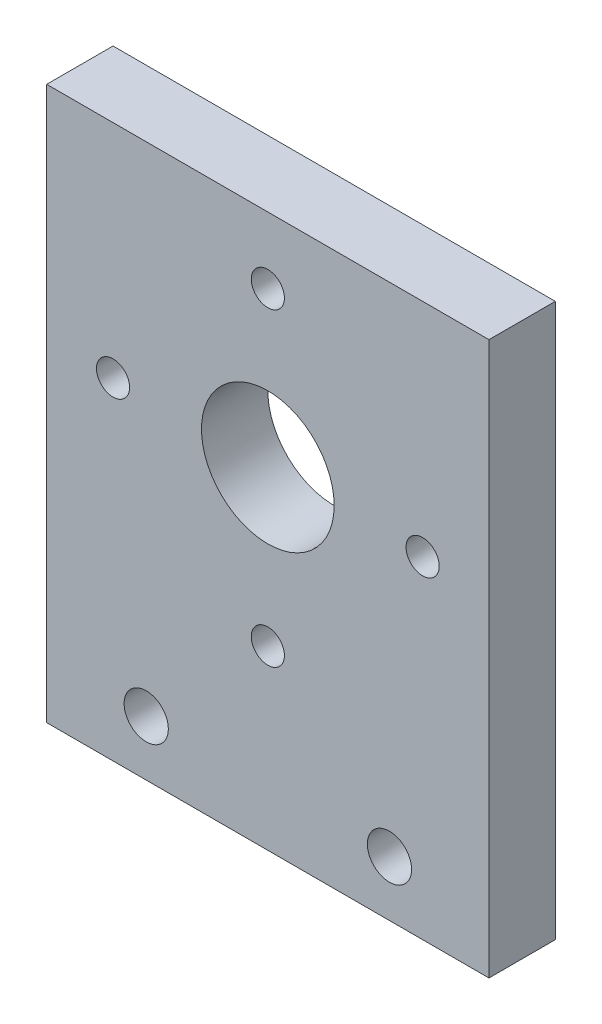
ISO-10303-21;
HEADER;
FILE_DESCRIPTION(('STEP AP214'),'2;1');
FILE_NAME('part.step','',(''),(''),'','','');
FILE_SCHEMA(('AUTOMOTIVE_DESIGN { 1 0 10303 214 1 1 1 1 }'));
ENDSEC;
DATA;
#1=APPLICATION_CONTEXT('core data for automotive mechanical design processes');
#2=APPLICATION_PROTOCOL_DEFINITION('international standard','automotive_design',2000,#1);
#3=PRODUCT_CONTEXT('',#1,'mechanical');
#4=PRODUCT('Part','Part','',(#3));
#5=PRODUCT_RELATED_PRODUCT_CATEGORY('part','',(#4));
#6=PRODUCT_DEFINITION_FORMATION('','',#4);
#7=PRODUCT_DEFINITION_CONTEXT('part definition',#1,'design');
#8=PRODUCT_DEFINITION('design','',#6,#7);
#9=PRODUCT_DEFINITION_SHAPE('','',#8);
#10=(LENGTH_UNIT() NAMED_UNIT(*) SI_UNIT(.MILLI.,.METRE.));
#11=(NAMED_UNIT(*) PLANE_ANGLE_UNIT() SI_UNIT($,.RADIAN.));
#12=(NAMED_UNIT(*) SI_UNIT($,.STERADIAN.) SOLID_ANGLE_UNIT());
#13=UNCERTAINTY_MEASURE_WITH_UNIT(LENGTH_MEASURE(1.E-05),#10,'distance_accuracy_value','');
#14=(GEOMETRIC_REPRESENTATION_CONTEXT(3) GLOBAL_UNCERTAINTY_ASSIGNED_CONTEXT((#13)) GLOBAL_UNIT_ASSIGNED_CONTEXT((#10,
#11,#12)) REPRESENTATION_CONTEXT('',''));
#15=CARTESIAN_POINT('',(0.,0.,0.));
#16=DIRECTION('',(0.,0.,1.));
#17=DIRECTION('',(1.,0.,0.));
#18=AXIS2_PLACEMENT_3D('',#15,#16,#17);
#19=CARTESIAN_POINT('',(20.,0.,3.));
#20=DIRECTION('',(-1.,0.,0.));
#21=DIRECTION('',(0.,0.,1.));
#22=AXIS2_PLACEMENT_3D('',#19,#20,#21);
#23=PLANE('',#22);
#24=DIRECTION('',(0.,1.,0.));
#25=VECTOR('',#24,1.);
#26=CARTESIAN_POINT('',(20.,0.,0.));
#27=LINE('',#26,#25);
#28=CARTESIAN_POINT('',(20.,-25.,0.));
#29=VERTEX_POINT('',#28);
#30=CARTESIAN_POINT('',(20.,0.,0.));
#31=VERTEX_POINT('',#30);
#32=EDGE_CURVE('E146',#29,#31,#27,.T.);
#33=ORIENTED_EDGE('',*,*,#32,.T.);
#34=DIRECTION('',(0.,0.,-1.));
#35=VECTOR('',#34,1.);
#36=CARTESIAN_POINT('',(20.,0.,3.));
#37=LINE('',#36,#35);
#38=CARTESIAN_POINT('',(20.,0.,3.));
#39=VERTEX_POINT('',#38);
#40=EDGE_CURVE('E11',#39,#31,#37,.T.);
#41=ORIENTED_EDGE('',*,*,#40,.F.);
#42=DIRECTION('',(0.,1.,0.));
#43=VECTOR('',#42,1.);
#44=CARTESIAN_POINT('',(20.,0.,3.));
#45=LINE('',#44,#43);
#46=CARTESIAN_POINT('',(20.,-25.,3.));
#47=VERTEX_POINT('',#46);
#48=EDGE_CURVE('E89',#47,#39,#45,.T.);
#49=ORIENTED_EDGE('',*,*,#48,.F.);
#50=DIRECTION('',(0.,0.,-1.));
#51=VECTOR('',#50,1.);
#52=CARTESIAN_POINT('',(20.,-25.,3.));
#53=LINE('',#52,#51);
#54=EDGE_CURVE('E137',#47,#29,#53,.T.);
#55=ORIENTED_EDGE('',*,*,#54,.T.);
#56=EDGE_LOOP('',(#33,#41,#49,#55));
#57=FACE_BOUND('',#56,.T.);
#58=ADVANCED_FACE('F45',(#57),#23,.F.);
#59=CARTESIAN_POINT('',(0.,0.,3.));
#60=DIRECTION('',(0.,1.,0.));
#61=DIRECTION('',(0.,0.,1.));
#62=AXIS2_PLACEMENT_3D('',#59,#60,#61);
#63=PLANE('',#62);
#64=DIRECTION('',(1.,0.,0.));
#65=VECTOR('',#64,1.);
#66=CARTESIAN_POINT('',(0.,0.,0.));
#67=LINE('',#66,#65);
#68=CARTESIAN_POINT('',(0.,0.,0.));
#69=VERTEX_POINT('',#68);
#70=EDGE_CURVE('E99',#69,#31,#67,.T.);
#71=ORIENTED_EDGE('',*,*,#70,.F.);
#72=DIRECTION('',(0.,0.,-1.));
#73=VECTOR('',#72,1.);
#74=CARTESIAN_POINT('',(0.,0.,3.));
#75=LINE('',#74,#73);
#76=CARTESIAN_POINT('',(0.,0.,3.));
#77=VERTEX_POINT('',#76);
#78=EDGE_CURVE('E55',#77,#69,#75,.T.);
#79=ORIENTED_EDGE('',*,*,#78,.F.);
#80=DIRECTION('',(1.,0.,0.));
#81=VECTOR('',#80,1.);
#82=CARTESIAN_POINT('',(0.,0.,3.));
#83=LINE('',#82,#81);
#84=EDGE_CURVE('E97',#77,#39,#83,.T.);
#85=ORIENTED_EDGE('',*,*,#84,.T.);
#86=ORIENTED_EDGE('',*,*,#40,.T.);
#87=EDGE_LOOP('',(#71,#79,#85,#86));
#88=FACE_BOUND('',#87,.T.);
#89=ADVANCED_FACE('F96',(#88),#63,.T.);
#90=CARTESIAN_POINT('',(0.,0.,3.));
#91=DIRECTION('',(1.,0.,0.));
#92=DIRECTION('',(0.,1.,0.));
#93=AXIS2_PLACEMENT_3D('',#90,#91,#92);
#94=PLANE('',#93);
#95=DIRECTION('',(0.,-1.,0.));
#96=VECTOR('',#95,1.);
#97=CARTESIAN_POINT('',(0.,0.,0.));
#98=LINE('',#97,#96);
#99=CARTESIAN_POINT('',(0.,-25.,0.));
#100=VERTEX_POINT('',#99);
#101=EDGE_CURVE('E78',#69,#100,#98,.T.);
#102=ORIENTED_EDGE('',*,*,#101,.T.);
#103=DIRECTION('',(0.,0.,-1.));
#104=VECTOR('',#103,1.);
#105=CARTESIAN_POINT('',(0.,-25.,3.));
#106=LINE('',#105,#104);
#107=CARTESIAN_POINT('',(0.,-25.,3.));
#108=VERTEX_POINT('',#107);
#109=EDGE_CURVE('E101',#108,#100,#106,.T.);
#110=ORIENTED_EDGE('',*,*,#109,.F.);
#111=DIRECTION('',(0.,-1.,0.));
#112=VECTOR('',#111,1.);
#113=CARTESIAN_POINT('',(0.,0.,3.));
#114=LINE('',#113,#112);
#115=EDGE_CURVE('E102',#77,#108,#114,.T.);
#116=ORIENTED_EDGE('',*,*,#115,.F.);
#117=ORIENTED_EDGE('',*,*,#78,.T.);
#118=EDGE_LOOP('',(#102,#110,#116,#117));
#119=FACE_BOUND('',#118,.T.);
#120=ADVANCED_FACE('F103',(#119),#94,.F.);
#121=CARTESIAN_POINT('',(17.,-10.,3.));
#122=DIRECTION('',(0.,0.,-1.));
#123=DIRECTION('',(-1.,0.,0.));
#124=AXIS2_PLACEMENT_3D('',#121,#122,#123);
#125=CYLINDRICAL_SURFACE('',#124,0.750000000000002);
#126=CARTESIAN_POINT('',(17.,-10.,3.));
#127=DIRECTION('',(0.,0.,1.));
#128=DIRECTION('',(1.,0.,0.));
#129=AXIS2_PLACEMENT_3D('',#126,#127,#128);
#130=CIRCLE('',#129,0.750000000000002);
#131=CARTESIAN_POINT('',(17.75,-10.,3.));
#132=VERTEX_POINT('',#131);
#133=EDGE_CURVE('E129',#132,#132,#130,.T.);
#134=ORIENTED_EDGE('',*,*,#133,.T.);
#135=EDGE_LOOP('',(#134));
#136=FACE_BOUND('',#135,.T.);
#137=CARTESIAN_POINT('',(17.,-10.,0.));
#138=DIRECTION('',(0.,0.,1.));
#139=DIRECTION('',(1.,0.,0.));
#140=AXIS2_PLACEMENT_3D('',#137,#138,#139);
#141=CIRCLE('',#140,0.750000000000002);
#142=CARTESIAN_POINT('',(17.75,-10.,0.));
#143=VERTEX_POINT('',#142);
#144=EDGE_CURVE('E168',#143,#143,#141,.T.);
#145=ORIENTED_EDGE('',*,*,#144,.F.);
#146=EDGE_LOOP('',(#145));
#147=FACE_BOUND('',#146,.T.);
#148=ADVANCED_FACE('F221',(#136,#147),#125,.F.);
#149=CARTESIAN_POINT('',(10.,-3.,3.));
#150=DIRECTION('',(0.,0.,-1.));
#151=DIRECTION('',(-1.,0.,0.));
#152=AXIS2_PLACEMENT_3D('',#149,#150,#151);
#153=CYLINDRICAL_SURFACE('',#152,0.75);
#154=CARTESIAN_POINT('',(10.,-3.,3.));
#155=DIRECTION('',(0.,0.,1.));
#156=DIRECTION('',(1.,0.,0.));
#157=AXIS2_PLACEMENT_3D('',#154,#155,#156);
#158=CIRCLE('',#157,0.75);
#159=CARTESIAN_POINT('',(10.75,-3.,3.));
#160=VERTEX_POINT('',#159);
#161=EDGE_CURVE('E125',#160,#160,#158,.T.);
#162=ORIENTED_EDGE('',*,*,#161,.T.);
#163=EDGE_LOOP('',(#162));
#164=FACE_BOUND('',#163,.T.);
#165=CARTESIAN_POINT('',(10.,-3.,0.));
#166=DIRECTION('',(0.,0.,1.));
#167=DIRECTION('',(1.,0.,0.));
#168=AXIS2_PLACEMENT_3D('',#165,#166,#167);
#169=CIRCLE('',#168,0.75);
#170=CARTESIAN_POINT('',(10.75,-3.,0.));
#171=VERTEX_POINT('',#170);
#172=EDGE_CURVE('E164',#171,#171,#169,.T.);
#173=ORIENTED_EDGE('',*,*,#172,.F.);
#174=EDGE_LOOP('',(#173));
#175=FACE_BOUND('',#174,.T.);
#176=ADVANCED_FACE('F224',(#164,#175),#153,.F.);
#177=CARTESIAN_POINT('',(3.,-10.,3.));
#178=DIRECTION('',(0.,0.,-1.));
#179=DIRECTION('',(-1.,0.,0.));
#180=AXIS2_PLACEMENT_3D('',#177,#178,#179);
#181=CYLINDRICAL_SURFACE('',#180,0.75);
#182=CARTESIAN_POINT('',(3.,-10.,3.));
#183=DIRECTION('',(0.,0.,1.));
#184=DIRECTION('',(1.,0.,0.));
#185=AXIS2_PLACEMENT_3D('',#182,#183,#184);
#186=CIRCLE('',#185,0.75);
#187=CARTESIAN_POINT('',(3.75,-10.,3.));
#188=VERTEX_POINT('',#187);
#189=EDGE_CURVE('E121',#188,#188,#186,.T.);
#190=ORIENTED_EDGE('',*,*,#189,.T.);
#191=EDGE_LOOP('',(#190));
#192=FACE_BOUND('',#191,.T.);
#193=CARTESIAN_POINT('',(3.,-10.,0.));
#194=DIRECTION('',(0.,0.,1.));
#195=DIRECTION('',(1.,0.,0.));
#196=AXIS2_PLACEMENT_3D('',#193,#194,#195);
#197=CIRCLE('',#196,0.75);
#198=CARTESIAN_POINT('',(3.75,-10.,0.));
#199=VERTEX_POINT('',#198);
#200=EDGE_CURVE('E160',#199,#199,#197,.T.);
#201=ORIENTED_EDGE('',*,*,#200,.F.);
#202=EDGE_LOOP('',(#201));
#203=FACE_BOUND('',#202,.T.);
#204=ADVANCED_FACE('F228',(#192,#203),#181,.F.);
#205=CARTESIAN_POINT('',(10.,-17.,3.));
#206=DIRECTION('',(0.,0.,-1.));
#207=DIRECTION('',(-1.,0.,0.));
#208=AXIS2_PLACEMENT_3D('',#205,#206,#207);
#209=CYLINDRICAL_SURFACE('',#208,0.75);
#210=CARTESIAN_POINT('',(10.,-17.,3.));
#211=DIRECTION('',(0.,0.,1.));
#212=DIRECTION('',(1.,0.,0.));
#213=AXIS2_PLACEMENT_3D('',#210,#211,#212);
#214=CIRCLE('',#213,0.75);
#215=CARTESIAN_POINT('',(10.75,-17.,3.));
#216=VERTEX_POINT('',#215);
#217=EDGE_CURVE('E117',#216,#216,#214,.T.);
#218=ORIENTED_EDGE('',*,*,#217,.T.);
#219=EDGE_LOOP('',(#218));
#220=FACE_BOUND('',#219,.T.);
#221=CARTESIAN_POINT('',(10.,-17.,0.));
#222=DIRECTION('',(0.,0.,1.));
#223=DIRECTION('',(1.,0.,0.));
#224=AXIS2_PLACEMENT_3D('',#221,#222,#223);
#225=CIRCLE('',#224,0.75);
#226=CARTESIAN_POINT('',(10.75,-17.,0.));
#227=VERTEX_POINT('',#226);
#228=EDGE_CURVE('E156',#227,#227,#225,.T.);
#229=ORIENTED_EDGE('',*,*,#228,.F.);
#230=EDGE_LOOP('',(#229));
#231=FACE_BOUND('',#230,.T.);
#232=ADVANCED_FACE('F202',(#220,#231),#209,.F.);
#233=CARTESIAN_POINT('',(0.,-25.,3.));
#234=DIRECTION('',(0.,1.,0.));
#235=DIRECTION('',(0.,0.,1.));
#236=AXIS2_PLACEMENT_3D('',#233,#234,#235);
#237=PLANE('',#236);
#238=DIRECTION('',(1.,0.,0.));
#239=VECTOR('',#238,1.);
#240=CARTESIAN_POINT('',(0.,-25.,0.));
#241=LINE('',#240,#239);
#242=EDGE_CURVE('E84',#100,#29,#241,.T.);
#243=ORIENTED_EDGE('',*,*,#242,.T.);
#244=ORIENTED_EDGE('',*,*,#54,.F.);
#245=DIRECTION('',(1.,0.,0.));
#246=VECTOR('',#245,1.);
#247=CARTESIAN_POINT('',(0.,-25.,3.));
#248=LINE('',#247,#246);
#249=EDGE_CURVE('E63',#108,#47,#248,.T.);
#250=ORIENTED_EDGE('',*,*,#249,.F.);
#251=ORIENTED_EDGE('',*,*,#109,.T.);
#252=EDGE_LOOP('',(#243,#244,#250,#251));
#253=FACE_BOUND('',#252,.T.);
#254=ADVANCED_FACE('F180',(#253),#237,.F.);
#255=CARTESIAN_POINT('',(4.5,-22.5,3.));
#256=DIRECTION('',(0.,0.,-1.));
#257=DIRECTION('',(-1.,0.,0.));
#258=AXIS2_PLACEMENT_3D('',#255,#256,#257);
#259=CYLINDRICAL_SURFACE('',#258,1.);
#260=CARTESIAN_POINT('',(4.5,-22.5,3.));
#261=DIRECTION('',(0.,0.,1.));
#262=DIRECTION('',(1.,0.,0.));
#263=AXIS2_PLACEMENT_3D('',#260,#261,#262);
#264=CIRCLE('',#263,1.);
#265=CARTESIAN_POINT('',(5.5,-22.5,3.));
#266=VERTEX_POINT('',#265);
#267=EDGE_CURVE('E111',#266,#266,#264,.T.);
#268=ORIENTED_EDGE('',*,*,#267,.T.);
#269=EDGE_LOOP('',(#268));
#270=FACE_BOUND('',#269,.T.);
#271=CARTESIAN_POINT('',(4.5,-22.5,0.));
#272=DIRECTION('',(0.,0.,1.));
#273=DIRECTION('',(1.,0.,0.));
#274=AXIS2_PLACEMENT_3D('',#271,#272,#273);
#275=CIRCLE('',#274,1.);
#276=CARTESIAN_POINT('',(5.5,-22.5,0.));
#277=VERTEX_POINT('',#276);
#278=EDGE_CURVE('E142',#277,#277,#275,.T.);
#279=ORIENTED_EDGE('',*,*,#278,.F.);
#280=EDGE_LOOP('',(#279));
#281=FACE_BOUND('',#280,.T.);
#282=ADVANCED_FACE('F193',(#270,#281),#259,.F.);
#283=CARTESIAN_POINT('',(15.5,-22.5,3.));
#284=DIRECTION('',(0.,0.,-1.));
#285=DIRECTION('',(-1.,0.,0.));
#286=AXIS2_PLACEMENT_3D('',#283,#284,#285);
#287=CYLINDRICAL_SURFACE('',#286,1.);
#288=CARTESIAN_POINT('',(15.5,-22.5,3.));
#289=DIRECTION('',(0.,0.,1.));
#290=DIRECTION('',(1.,0.,0.));
#291=AXIS2_PLACEMENT_3D('',#288,#289,#290);
#292=CIRCLE('',#291,1.);
#293=CARTESIAN_POINT('',(16.5,-22.5,3.));
#294=VERTEX_POINT('',#293);
#295=EDGE_CURVE('E176',#294,#294,#292,.T.);
#296=ORIENTED_EDGE('',*,*,#295,.T.);
#297=EDGE_LOOP('',(#296));
#298=FACE_BOUND('',#297,.T.);
#299=CARTESIAN_POINT('',(15.5,-22.5,0.));
#300=DIRECTION('',(0.,0.,1.));
#301=DIRECTION('',(1.,0.,0.));
#302=AXIS2_PLACEMENT_3D('',#299,#300,#301);
#303=CIRCLE('',#302,1.);
#304=CARTESIAN_POINT('',(16.5,-22.5,0.));
#305=VERTEX_POINT('',#304);
#306=EDGE_CURVE('E138',#305,#305,#303,.T.);
#307=ORIENTED_EDGE('',*,*,#306,.F.);
#308=EDGE_LOOP('',(#307));
#309=FACE_BOUND('',#308,.T.);
#310=ADVANCED_FACE('F47',(#298,#309),#287,.F.);
#311=CARTESIAN_POINT('',(10.,-10.,3.));
#312=DIRECTION('',(0.,0.,-1.));
#313=DIRECTION('',(-1.,0.,0.));
#314=AXIS2_PLACEMENT_3D('',#311,#312,#313);
#315=CYLINDRICAL_SURFACE('',#314,3.);
#316=CARTESIAN_POINT('',(10.,-10.,3.));
#317=DIRECTION('',(0.,0.,1.));
#318=DIRECTION('',(1.,0.,0.));
#319=AXIS2_PLACEMENT_3D('',#316,#317,#318);
#320=CIRCLE('',#319,3.);
#321=CARTESIAN_POINT('',(13.,-10.,3.));
#322=VERTEX_POINT('',#321);
#323=EDGE_CURVE('E133',#322,#322,#320,.T.);
#324=ORIENTED_EDGE('',*,*,#323,.T.);
#325=EDGE_LOOP('',(#324));
#326=FACE_BOUND('',#325,.T.);
#327=CARTESIAN_POINT('',(10.,-10.,0.));
#328=DIRECTION('',(0.,0.,1.));
#329=DIRECTION('',(1.,0.,0.));
#330=AXIS2_PLACEMENT_3D('',#327,#328,#329);
#331=CIRCLE('',#330,3.);
#332=CARTESIAN_POINT('',(13.,-10.,0.));
#333=VERTEX_POINT('',#332);
#334=EDGE_CURVE('E172',#333,#333,#331,.T.);
#335=ORIENTED_EDGE('',*,*,#334,.F.);
#336=EDGE_LOOP('',(#335));
#337=FACE_BOUND('',#336,.T.);
#338=ADVANCED_FACE('F200',(#326,#337),#315,.F.);
#339=CARTESIAN_POINT('',(0.,0.,3.));
#340=DIRECTION('',(0.,0.,1.));
#341=DIRECTION('',(1.,0.,0.));
#342=AXIS2_PLACEMENT_3D('',#339,#340,#341);
#343=PLANE('',#342);
#344=ORIENTED_EDGE('',*,*,#295,.F.);
#345=EDGE_LOOP('',(#344));
#346=FACE_BOUND('',#345,.T.);
#347=ORIENTED_EDGE('',*,*,#267,.F.);
#348=EDGE_LOOP('',(#347));
#349=FACE_BOUND('',#348,.T.);
#350=ORIENTED_EDGE('',*,*,#48,.T.);
#351=ORIENTED_EDGE('',*,*,#84,.F.);
#352=ORIENTED_EDGE('',*,*,#115,.T.);
#353=ORIENTED_EDGE('',*,*,#249,.T.);
#354=EDGE_LOOP('',(#350,#351,#352,#353));
#355=FACE_BOUND('',#354,.T.);
#356=ORIENTED_EDGE('',*,*,#217,.F.);
#357=EDGE_LOOP('',(#356));
#358=FACE_BOUND('',#357,.T.);
#359=ORIENTED_EDGE('',*,*,#189,.F.);
#360=EDGE_LOOP('',(#359));
#361=FACE_BOUND('',#360,.T.);
#362=ORIENTED_EDGE('',*,*,#161,.F.);
#363=EDGE_LOOP('',(#362));
#364=FACE_BOUND('',#363,.T.);
#365=ORIENTED_EDGE('',*,*,#133,.F.);
#366=EDGE_LOOP('',(#365));
#367=FACE_BOUND('',#366,.T.);
#368=ORIENTED_EDGE('',*,*,#323,.F.);
#369=EDGE_LOOP('',(#368));
#370=FACE_BOUND('',#369,.T.);
#371=ADVANCED_FACE('F106',(#346,#349,#355,#358,#361,#364,#367,#370),#343,.T.);
#372=CARTESIAN_POINT('',(0.,0.,0.));
#373=DIRECTION('',(0.,0.,1.));
#374=DIRECTION('',(1.,0.,0.));
#375=AXIS2_PLACEMENT_3D('',#372,#373,#374);
#376=PLANE('',#375);
#377=ORIENTED_EDGE('',*,*,#306,.T.);
#378=EDGE_LOOP('',(#377));
#379=FACE_BOUND('',#378,.T.);
#380=ORIENTED_EDGE('',*,*,#278,.T.);
#381=EDGE_LOOP('',(#380));
#382=FACE_BOUND('',#381,.T.);
#383=ORIENTED_EDGE('',*,*,#32,.F.);
#384=ORIENTED_EDGE('',*,*,#242,.F.);
#385=ORIENTED_EDGE('',*,*,#101,.F.);
#386=ORIENTED_EDGE('',*,*,#70,.T.);
#387=EDGE_LOOP('',(#383,#384,#385,#386));
#388=FACE_BOUND('',#387,.T.);
#389=ORIENTED_EDGE('',*,*,#228,.T.);
#390=EDGE_LOOP('',(#389));
#391=FACE_BOUND('',#390,.T.);
#392=ORIENTED_EDGE('',*,*,#200,.T.);
#393=EDGE_LOOP('',(#392));
#394=FACE_BOUND('',#393,.T.);
#395=ORIENTED_EDGE('',*,*,#172,.T.);
#396=EDGE_LOOP('',(#395));
#397=FACE_BOUND('',#396,.T.);
#398=ORIENTED_EDGE('',*,*,#144,.T.);
#399=EDGE_LOOP('',(#398));
#400=FACE_BOUND('',#399,.T.);
#401=ORIENTED_EDGE('',*,*,#334,.T.);
#402=EDGE_LOOP('',(#401));
#403=FACE_BOUND('',#402,.T.);
#404=ADVANCED_FACE('F183',(#379,#382,#388,#391,#394,#397,#400,#403),#376,.F.);
#405=CLOSED_SHELL('',(#58,#89,#120,#148,#176,#204,#232,#254,#282,#310,#338,#371,#404));
#406=MANIFOLD_SOLID_BREP('B2',#405);
#407=ADVANCED_BREP_SHAPE_REPRESENTATION('',(#18,#406),#14);
#408=SHAPE_DEFINITION_REPRESENTATION(#9,#407);
ENDSEC;
END-ISO-10303-21;
